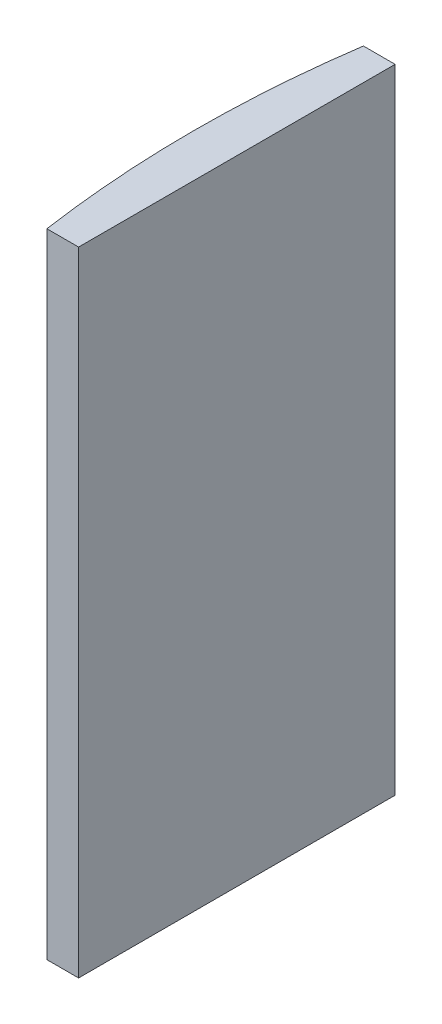
ISO-10303-21;
HEADER;
FILE_DESCRIPTION(('STEP AP214'),'2;1');
FILE_NAME('part.step','',(''),(''),'','','');
FILE_SCHEMA(('AUTOMOTIVE_DESIGN { 1 0 10303 214 1 1 1 1 }'));
ENDSEC;
DATA;
#1=APPLICATION_CONTEXT('core data for automotive mechanical design processes');
#2=APPLICATION_PROTOCOL_DEFINITION('international standard','automotive_design',2000,#1);
#3=PRODUCT_CONTEXT('',#1,'mechanical');
#4=PRODUCT('Part','Part','',(#3));
#5=PRODUCT_RELATED_PRODUCT_CATEGORY('part','',(#4));
#6=PRODUCT_DEFINITION_FORMATION('','',#4);
#7=PRODUCT_DEFINITION_CONTEXT('part definition',#1,'design');
#8=PRODUCT_DEFINITION('design','',#6,#7);
#9=PRODUCT_DEFINITION_SHAPE('','',#8);
#10=(LENGTH_UNIT() NAMED_UNIT(*) SI_UNIT(.MILLI.,.METRE.));
#11=(NAMED_UNIT(*) PLANE_ANGLE_UNIT() SI_UNIT($,.RADIAN.));
#12=(NAMED_UNIT(*) SI_UNIT($,.STERADIAN.) SOLID_ANGLE_UNIT());
#13=UNCERTAINTY_MEASURE_WITH_UNIT(LENGTH_MEASURE(1.E-05),#10,'distance_accuracy_value','');
#14=(GEOMETRIC_REPRESENTATION_CONTEXT(3) GLOBAL_UNCERTAINTY_ASSIGNED_CONTEXT((#13)) GLOBAL_UNIT_ASSIGNED_CONTEXT((#10,
#11,#12)) REPRESENTATION_CONTEXT('',''));
#15=CARTESIAN_POINT('',(0.,0.,0.));
#16=DIRECTION('',(0.,0.,1.));
#17=DIRECTION('',(1.,0.,0.));
#18=AXIS2_PLACEMENT_3D('',#15,#16,#17);
#19=CARTESIAN_POINT('',(4.35520433485127,60.,0.));
#20=DIRECTION('',(0.,-1.,0.));
#21=DIRECTION('',(0.,0.,-1.));
#22=AXIS2_PLACEMENT_3D('',#19,#20,#21);
#23=CYLINDRICAL_SURFACE('',#22,103.4);
#24=CARTESIAN_POINT('',(4.35520433485127,0.,0.));
#25=DIRECTION('',(0.,1.,0.));
#26=DIRECTION('',(0.,0.,1.));
#27=AXIS2_PLACEMENT_3D('',#24,#25,#26);
#28=CIRCLE('',#27,103.4);
#29=CARTESIAN_POINT('',(-97.9510027104693,0.,-15.));
#30=VERTEX_POINT('',#29);
#31=CARTESIAN_POINT('',(-97.9510027104693,0.,15.));
#32=VERTEX_POINT('',#31);
#33=EDGE_CURVE('E100',#30,#32,#28,.T.);
#34=ORIENTED_EDGE('',*,*,#33,.T.);
#35=DIRECTION('',(0.,-1.,0.));
#36=VECTOR('',#35,1.);
#37=CARTESIAN_POINT('',(-97.9510027104693,60.,15.));
#38=LINE('',#37,#36);
#39=CARTESIAN_POINT('',(-97.9510027104693,60.,15.));
#40=VERTEX_POINT('',#39);
#41=EDGE_CURVE('E11',#40,#32,#38,.T.);
#42=ORIENTED_EDGE('',*,*,#41,.F.);
#43=CARTESIAN_POINT('',(4.35520433485127,60.,0.));
#44=DIRECTION('',(0.,1.,0.));
#45=DIRECTION('',(0.,0.,1.));
#46=AXIS2_PLACEMENT_3D('',#43,#44,#45);
#47=CIRCLE('',#46,103.4);
#48=CARTESIAN_POINT('',(-97.9510027104693,60.,-15.));
#49=VERTEX_POINT('',#48);
#50=EDGE_CURVE('E88',#49,#40,#47,.T.);
#51=ORIENTED_EDGE('',*,*,#50,.F.);
#52=DIRECTION('',(0.,-1.,0.));
#53=VECTOR('',#52,1.);
#54=CARTESIAN_POINT('',(-97.9510027104693,60.,-15.));
#55=LINE('',#54,#53);
#56=EDGE_CURVE('E96',#49,#30,#55,.T.);
#57=ORIENTED_EDGE('',*,*,#56,.T.);
#58=EDGE_LOOP('',(#34,#42,#51,#57));
#59=FACE_BOUND('',#58,.T.);
#60=ADVANCED_FACE('F37',(#59),#23,.T.);
#61=CARTESIAN_POINT('',(-97.9510027104693,60.,15.));
#62=DIRECTION('',(0.,0.,-1.));
#63=DIRECTION('',(-1.,0.,0.));
#64=AXIS2_PLACEMENT_3D('',#61,#62,#63);
#65=PLANE('',#64);
#66=DIRECTION('',(1.,0.,0.));
#67=VECTOR('',#66,1.);
#68=CARTESIAN_POINT('',(-97.9510027104693,0.,15.));
#69=LINE('',#68,#67);
#70=CARTESIAN_POINT('',(-94.9447956651487,0.,15.));
#71=VERTEX_POINT('',#70);
#72=EDGE_CURVE('E92',#32,#71,#69,.T.);
#73=ORIENTED_EDGE('',*,*,#72,.T.);
#74=DIRECTION('',(0.,-1.,0.));
#75=VECTOR('',#74,1.);
#76=CARTESIAN_POINT('',(-94.9447956651487,60.,15.));
#77=LINE('',#76,#75);
#78=CARTESIAN_POINT('',(-94.9447956651487,60.,15.));
#79=VERTEX_POINT('',#78);
#80=EDGE_CURVE('E45',#79,#71,#77,.T.);
#81=ORIENTED_EDGE('',*,*,#80,.F.);
#82=DIRECTION('',(1.,0.,0.));
#83=VECTOR('',#82,1.);
#84=CARTESIAN_POINT('',(-97.9510027104693,60.,15.));
#85=LINE('',#84,#83);
#86=EDGE_CURVE('E83',#40,#79,#85,.T.);
#87=ORIENTED_EDGE('',*,*,#86,.F.);
#88=ORIENTED_EDGE('',*,*,#41,.T.);
#89=EDGE_LOOP('',(#73,#81,#87,#88));
#90=FACE_BOUND('',#89,.T.);
#91=ADVANCED_FACE('F91',(#90),#65,.F.);
#92=CARTESIAN_POINT('',(-94.9447956651488,60.,-15.));
#93=DIRECTION('',(-1.,0.,0.));
#94=DIRECTION('',(0.,0.,1.));
#95=AXIS2_PLACEMENT_3D('',#92,#93,#94);
#96=PLANE('',#95);
#97=DIRECTION('',(0.,0.,-1.));
#98=VECTOR('',#97,1.);
#99=CARTESIAN_POINT('',(-94.9447956651488,0.,-15.));
#100=LINE('',#99,#98);
#101=CARTESIAN_POINT('',(-94.9447956651488,0.,-15.));
#102=VERTEX_POINT('',#101);
#103=EDGE_CURVE('E70',#71,#102,#100,.T.);
#104=ORIENTED_EDGE('',*,*,#103,.T.);
#105=DIRECTION('',(0.,-1.,0.));
#106=VECTOR('',#105,1.);
#107=CARTESIAN_POINT('',(-94.9447956651488,60.,-15.));
#108=LINE('',#107,#106);
#109=CARTESIAN_POINT('',(-94.9447956651488,60.,-15.));
#110=VERTEX_POINT('',#109);
#111=EDGE_CURVE('E93',#110,#102,#108,.T.);
#112=ORIENTED_EDGE('',*,*,#111,.F.);
#113=DIRECTION('',(0.,0.,-1.));
#114=VECTOR('',#113,1.);
#115=CARTESIAN_POINT('',(-94.9447956651488,60.,-15.));
#116=LINE('',#115,#114);
#117=EDGE_CURVE('E86',#79,#110,#116,.T.);
#118=ORIENTED_EDGE('',*,*,#117,.F.);
#119=ORIENTED_EDGE('',*,*,#80,.T.);
#120=EDGE_LOOP('',(#104,#112,#118,#119));
#121=FACE_BOUND('',#120,.T.);
#122=ADVANCED_FACE('F94',(#121),#96,.F.);
#123=CARTESIAN_POINT('',(-97.9510027104693,60.,-15.));
#124=DIRECTION('',(0.,0.,1.));
#125=DIRECTION('',(1.,0.,0.));
#126=AXIS2_PLACEMENT_3D('',#123,#124,#125);
#127=PLANE('',#126);
#128=DIRECTION('',(-1.,0.,0.));
#129=VECTOR('',#128,1.);
#130=CARTESIAN_POINT('',(-97.9510027104693,0.,-15.));
#131=LINE('',#130,#129);
#132=EDGE_CURVE('E76',#102,#30,#131,.T.);
#133=ORIENTED_EDGE('',*,*,#132,.T.);
#134=ORIENTED_EDGE('',*,*,#56,.F.);
#135=DIRECTION('',(-1.,0.,0.));
#136=VECTOR('',#135,1.);
#137=CARTESIAN_POINT('',(-97.9510027104693,60.,-15.));
#138=LINE('',#137,#136);
#139=EDGE_CURVE('E53',#110,#49,#138,.T.);
#140=ORIENTED_EDGE('',*,*,#139,.F.);
#141=ORIENTED_EDGE('',*,*,#111,.T.);
#142=EDGE_LOOP('',(#133,#134,#140,#141));
#143=FACE_BOUND('',#142,.T.);
#144=ADVANCED_FACE('F107',(#143),#127,.F.);
#145=CARTESIAN_POINT('',(4.35520433485127,60.,0.));
#146=DIRECTION('',(0.,1.,0.));
#147=DIRECTION('',(0.,0.,1.));
#148=AXIS2_PLACEMENT_3D('',#145,#146,#147);
#149=PLANE('',#148);
#150=ORIENTED_EDGE('',*,*,#50,.T.);
#151=ORIENTED_EDGE('',*,*,#86,.T.);
#152=ORIENTED_EDGE('',*,*,#117,.T.);
#153=ORIENTED_EDGE('',*,*,#139,.T.);
#154=EDGE_LOOP('',(#150,#151,#152,#153));
#155=FACE_BOUND('',#154,.T.);
#156=ADVANCED_FACE('F84',(#155),#149,.T.);
#157=CARTESIAN_POINT('',(4.35520433485127,0.,0.));
#158=DIRECTION('',(0.,1.,0.));
#159=DIRECTION('',(0.,0.,1.));
#160=AXIS2_PLACEMENT_3D('',#157,#158,#159);
#161=PLANE('',#160);
#162=ORIENTED_EDGE('',*,*,#33,.F.);
#163=ORIENTED_EDGE('',*,*,#132,.F.);
#164=ORIENTED_EDGE('',*,*,#103,.F.);
#165=ORIENTED_EDGE('',*,*,#72,.F.);
#166=EDGE_LOOP('',(#162,#163,#164,#165));
#167=FACE_BOUND('',#166,.T.);
#168=ADVANCED_FACE('F110',(#167),#161,.F.);
#169=CLOSED_SHELL('',(#60,#91,#122,#144,#156,#168));
#170=MANIFOLD_SOLID_BREP('B2',#169);
#171=ADVANCED_BREP_SHAPE_REPRESENTATION('',(#18,#170),#14);
#172=SHAPE_DEFINITION_REPRESENTATION(#9,#171);
ENDSEC;
END-ISO-10303-21;
